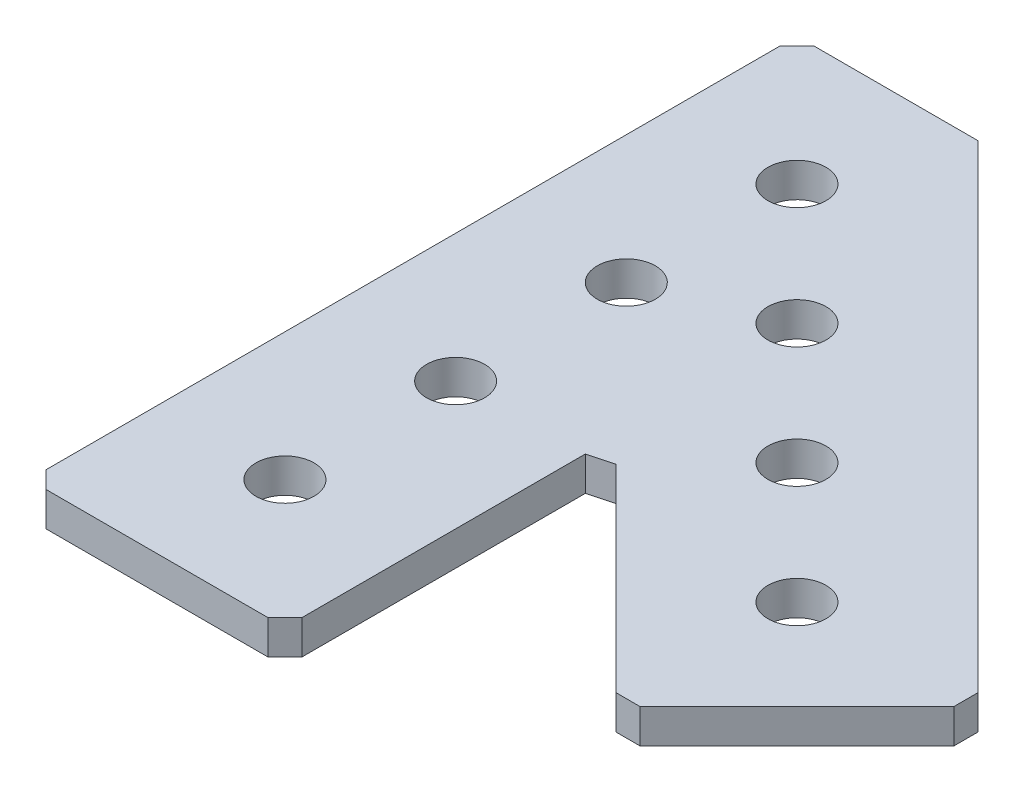
ISO-10303-21;
HEADER;
FILE_DESCRIPTION(('STEP AP214'),'2;1');
FILE_NAME('part.step','',(''),(''),'','','');
FILE_SCHEMA(('AUTOMOTIVE_DESIGN { 1 0 10303 214 1 1 1 1 }'));
ENDSEC;
DATA;
#1=APPLICATION_CONTEXT('core data for automotive mechanical design processes');
#2=APPLICATION_PROTOCOL_DEFINITION('international standard','automotive_design',2000,#1);
#3=PRODUCT_CONTEXT('',#1,'mechanical');
#4=PRODUCT('Part','Part','',(#3));
#5=PRODUCT_RELATED_PRODUCT_CATEGORY('part','',(#4));
#6=PRODUCT_DEFINITION_FORMATION('','',#4);
#7=PRODUCT_DEFINITION_CONTEXT('part definition',#1,'design');
#8=PRODUCT_DEFINITION('design','',#6,#7);
#9=PRODUCT_DEFINITION_SHAPE('','',#8);
#10=(LENGTH_UNIT() NAMED_UNIT(*) SI_UNIT(.MILLI.,.METRE.));
#11=(NAMED_UNIT(*) PLANE_ANGLE_UNIT() SI_UNIT($,.RADIAN.));
#12=(NAMED_UNIT(*) SI_UNIT($,.STERADIAN.) SOLID_ANGLE_UNIT());
#13=UNCERTAINTY_MEASURE_WITH_UNIT(LENGTH_MEASURE(1.E-05),#10,'distance_accuracy_value','');
#14=(GEOMETRIC_REPRESENTATION_CONTEXT(3) GLOBAL_UNCERTAINTY_ASSIGNED_CONTEXT((#13)) GLOBAL_UNIT_ASSIGNED_CONTEXT((#10,
#11,#12)) REPRESENTATION_CONTEXT('',''));
#15=CARTESIAN_POINT('',(0.,0.,0.));
#16=DIRECTION('',(0.,0.,1.));
#17=DIRECTION('',(1.,0.,0.));
#18=AXIS2_PLACEMENT_3D('',#15,#16,#17);
#19=CARTESIAN_POINT('',(7.50000000000001,2.,36.5));
#20=DIRECTION('',(-0.707106781186542,0.,-0.707106781186553));
#21=DIRECTION('',(-0.707106781186553,0.,0.707106781186542));
#22=AXIS2_PLACEMENT_3D('',#19,#20,#21);
#23=PLANE('',#22);
#24=DIRECTION('',(0.,1.,0.));
#25=VECTOR('',#24,1.);
#26=CARTESIAN_POINT('',(6.49999999999998,2.,37.5));
#27=LINE('',#26,#25);
#28=CARTESIAN_POINT('',(6.49999999999999,2.,37.5));
#29=VERTEX_POINT('',#28);
#30=CARTESIAN_POINT('',(6.49999999999998,0.,37.5));
#31=VERTEX_POINT('',#30);
#32=EDGE_CURVE('E133',#29,#31,#27,.F.);
#33=ORIENTED_EDGE('',*,*,#32,.T.);
#34=DIRECTION('',(-0.707106781186553,0.,0.707106781186542));
#35=VECTOR('',#34,1.);
#36=CARTESIAN_POINT('',(7.50000000000001,0.,36.5));
#37=LINE('',#36,#35);
#38=CARTESIAN_POINT('',(7.50000000000001,0.,36.5));
#39=VERTEX_POINT('',#38);
#40=EDGE_CURVE('E160',#39,#31,#37,.T.);
#41=ORIENTED_EDGE('',*,*,#40,.F.);
#42=DIRECTION('',(0.,1.,0.));
#43=VECTOR('',#42,1.);
#44=CARTESIAN_POINT('',(7.50000000000001,2.,36.5));
#45=LINE('',#44,#43);
#46=CARTESIAN_POINT('',(7.50000000000001,2.,36.5));
#47=VERTEX_POINT('',#46);
#48=EDGE_CURVE('E434',#39,#47,#45,.T.);
#49=ORIENTED_EDGE('',*,*,#48,.T.);
#50=DIRECTION('',(0.707106781186551,0.,-0.707106781186544));
#51=VECTOR('',#50,1.);
#52=CARTESIAN_POINT('',(6.49999999999998,2.,37.5));
#53=LINE('',#52,#51);
#54=EDGE_CURVE('E109',#29,#47,#53,.T.);
#55=ORIENTED_EDGE('',*,*,#54,.F.);
#56=EDGE_LOOP('',(#33,#41,#49,#55));
#57=FACE_BOUND('',#56,.T.);
#58=ADVANCED_FACE('F17',(#57),#23,.F.);
#59=CARTESIAN_POINT('',(8.9142135623731,2.,19.5208152801713));
#60=DIRECTION('',(0.258819045102524,0.,0.965925826289067));
#61=DIRECTION('',(0.965925826289067,0.,-0.258819045102524));
#62=AXIS2_PLACEMENT_3D('',#59,#60,#61);
#63=PLANE('',#62);
#64=DIRECTION('',(0.965925826289067,0.,-0.258819045102524));
#65=VECTOR('',#64,1.);
#66=CARTESIAN_POINT('',(8.9142135623731,0.,19.5208152801713));
#67=LINE('',#66,#65);
#68=CARTESIAN_POINT('',(7.50000000000001,0.,19.8997526621343));
#69=VERTEX_POINT('',#68);
#70=CARTESIAN_POINT('',(8.91421356237309,0.,19.5208152801713));
#71=VERTEX_POINT('',#70);
#72=EDGE_CURVE('E158',#69,#71,#67,.T.);
#73=ORIENTED_EDGE('',*,*,#72,.T.);
#74=DIRECTION('',(0.,1.,0.));
#75=VECTOR('',#74,1.);
#76=CARTESIAN_POINT('',(8.9142135623731,2.,19.5208152801713));
#77=LINE('',#76,#75);
#78=CARTESIAN_POINT('',(8.91421356237309,2.,19.5208152801713));
#79=VERTEX_POINT('',#78);
#80=EDGE_CURVE('E472',#71,#79,#77,.T.);
#81=ORIENTED_EDGE('',*,*,#80,.T.);
#82=DIRECTION('',(0.965925826289066,0.,-0.25881904510253));
#83=VECTOR('',#82,1.);
#84=CARTESIAN_POINT('',(7.50000000000001,2.,19.8997526621343));
#85=LINE('',#84,#83);
#86=CARTESIAN_POINT('',(7.50000000000001,2.,19.8997526621343));
#87=VERTEX_POINT('',#86);
#88=EDGE_CURVE('E148',#87,#79,#85,.T.);
#89=ORIENTED_EDGE('',*,*,#88,.F.);
#90=DIRECTION('',(0.,1.,0.));
#91=VECTOR('',#90,1.);
#92=CARTESIAN_POINT('',(7.5,2.,19.8997526621343));
#93=LINE('',#92,#91);
#94=EDGE_CURVE('E478',#87,#69,#93,.F.);
#95=ORIENTED_EDGE('',*,*,#94,.T.);
#96=EDGE_LOOP('',(#73,#81,#89,#95));
#97=FACE_BOUND('',#96,.T.);
#98=ADVANCED_FACE('F407',(#97),#63,.T.);
#99=CARTESIAN_POINT('',(21.920310216783,2.,31.1126983722081));
#100=DIRECTION('',(0.,0.,-1.));
#101=DIRECTION('',(-1.,0.,0.));
#102=AXIS2_PLACEMENT_3D('',#99,#100,#101);
#103=PLANE('',#102);
#104=DIRECTION('',(0.,1.,0.));
#105=VECTOR('',#104,1.);
#106=CARTESIAN_POINT('',(20.5060966544099,2.,31.1126983722081));
#107=LINE('',#106,#105);
#108=CARTESIAN_POINT('',(20.5060966544099,2.,31.1126983722081));
#109=VERTEX_POINT('',#108);
#110=CARTESIAN_POINT('',(20.5060966544099,0.,31.1126983722081));
#111=VERTEX_POINT('',#110);
#112=EDGE_CURVE('E475',#109,#111,#107,.F.);
#113=ORIENTED_EDGE('',*,*,#112,.T.);
#114=DIRECTION('',(-1.,0.,0.));
#115=VECTOR('',#114,1.);
#116=CARTESIAN_POINT('',(21.920310216783,0.,31.1126983722081));
#117=LINE('',#116,#115);
#118=CARTESIAN_POINT('',(21.920310216783,0.,31.1126983722081));
#119=VERTEX_POINT('',#118);
#120=EDGE_CURVE('E156',#119,#111,#117,.T.);
#121=ORIENTED_EDGE('',*,*,#120,.F.);
#122=DIRECTION('',(0.,1.,0.));
#123=VECTOR('',#122,1.);
#124=CARTESIAN_POINT('',(21.920310216783,2.,31.1126983722081));
#125=LINE('',#124,#123);
#126=CARTESIAN_POINT('',(21.920310216783,2.,31.1126983722081));
#127=VERTEX_POINT('',#126);
#128=EDGE_CURVE('E463',#119,#127,#125,.T.);
#129=ORIENTED_EDGE('',*,*,#128,.T.);
#130=DIRECTION('',(1.,0.,0.));
#131=VECTOR('',#130,1.);
#132=CARTESIAN_POINT('',(0.,2.,31.1126983722081));
#133=LINE('',#132,#131);
#134=EDGE_CURVE('E146',#109,#127,#133,.T.);
#135=ORIENTED_EDGE('',*,*,#134,.F.);
#136=EDGE_LOOP('',(#113,#121,#129,#135));
#137=FACE_BOUND('',#136,.T.);
#138=ADVANCED_FACE('F398',(#137),#103,.F.);
#139=CARTESIAN_POINT('',(31.1126983722081,2.,20.5060966544098));
#140=DIRECTION('',(-1.,0.,0.));
#141=DIRECTION('',(0.,0.,1.));
#142=AXIS2_PLACEMENT_3D('',#139,#140,#141);
#143=PLANE('',#142);
#144=DIRECTION('',(0.,1.,0.));
#145=VECTOR('',#144,1.);
#146=CARTESIAN_POINT('',(31.1126983722081,2.,21.9203102167829));
#147=LINE('',#146,#145);
#148=CARTESIAN_POINT('',(31.1126983722081,2.,21.9203102167829));
#149=VERTEX_POINT('',#148);
#150=CARTESIAN_POINT('',(31.1126983722081,0.,21.9203102167829));
#151=VERTEX_POINT('',#150);
#152=EDGE_CURVE('E466',#149,#151,#147,.F.);
#153=ORIENTED_EDGE('',*,*,#152,.T.);
#154=DIRECTION('',(0.,0.,1.));
#155=VECTOR('',#154,1.);
#156=CARTESIAN_POINT('',(31.1126983722081,0.,20.5060966544098));
#157=LINE('',#156,#155);
#158=CARTESIAN_POINT('',(31.1126983722081,0.,20.5060966544098));
#159=VERTEX_POINT('',#158);
#160=EDGE_CURVE('E154',#159,#151,#157,.T.);
#161=ORIENTED_EDGE('',*,*,#160,.F.);
#162=DIRECTION('',(0.,1.,0.));
#163=VECTOR('',#162,1.);
#164=CARTESIAN_POINT('',(31.1126983722081,2.,20.5060966544098));
#165=LINE('',#164,#163);
#166=CARTESIAN_POINT('',(31.1126983722081,2.,20.5060966544098));
#167=VERTEX_POINT('',#166);
#168=EDGE_CURVE('E457',#159,#167,#165,.T.);
#169=ORIENTED_EDGE('',*,*,#168,.T.);
#170=DIRECTION('',(0.,0.,1.));
#171=VECTOR('',#170,1.);
#172=CARTESIAN_POINT('',(31.1126983722081,2.,0.));
#173=LINE('',#172,#171);
#174=EDGE_CURVE('E144',#149,#167,#173,.F.);
#175=ORIENTED_EDGE('',*,*,#174,.F.);
#176=EDGE_LOOP('',(#153,#161,#169,#175));
#177=FACE_BOUND('',#176,.T.);
#178=ADVANCED_FACE('F390',(#177),#143,.F.);
#179=CARTESIAN_POINT('',(-7.5,2.,-6.5));
#180=DIRECTION('',(0.707106781186545,0.,0.70710678118655));
#181=DIRECTION('',(0.70710678118655,0.,-0.707106781186545));
#182=AXIS2_PLACEMENT_3D('',#179,#180,#181);
#183=PLANE('',#182);
#184=DIRECTION('',(0.,1.,0.));
#185=VECTOR('',#184,1.);
#186=CARTESIAN_POINT('',(-6.49999999999999,2.,-7.5));
#187=LINE('',#186,#185);
#188=CARTESIAN_POINT('',(-6.5,2.,-7.5));
#189=VERTEX_POINT('',#188);
#190=CARTESIAN_POINT('',(-6.5,0.,-7.5));
#191=VERTEX_POINT('',#190);
#192=EDGE_CURVE('E447',#189,#191,#187,.F.);
#193=ORIENTED_EDGE('',*,*,#192,.T.);
#194=DIRECTION('',(0.70710678118655,0.,-0.707106781186545));
#195=VECTOR('',#194,1.);
#196=CARTESIAN_POINT('',(-7.5,0.,-6.5));
#197=LINE('',#196,#195);
#198=CARTESIAN_POINT('',(-7.5,0.,-6.5));
#199=VERTEX_POINT('',#198);
#200=EDGE_CURVE('E35',#199,#191,#197,.T.);
#201=ORIENTED_EDGE('',*,*,#200,.F.);
#202=DIRECTION('',(0.,1.,0.));
#203=VECTOR('',#202,1.);
#204=CARTESIAN_POINT('',(-7.5,2.,-6.5));
#205=LINE('',#204,#203);
#206=CARTESIAN_POINT('',(-7.5,2.,-6.5));
#207=VERTEX_POINT('',#206);
#208=EDGE_CURVE('E445',#199,#207,#205,.T.);
#209=ORIENTED_EDGE('',*,*,#208,.T.);
#210=DIRECTION('',(-0.70710678118655,0.,0.707106781186545));
#211=VECTOR('',#210,1.);
#212=CARTESIAN_POINT('',(-6.49999999999999,2.,-7.5));
#213=LINE('',#212,#211);
#214=EDGE_CURVE('E125',#189,#207,#213,.T.);
#215=ORIENTED_EDGE('',*,*,#214,.F.);
#216=EDGE_LOOP('',(#193,#201,#209,#215));
#217=FACE_BOUND('',#216,.T.);
#218=ADVANCED_FACE('F382',(#217),#183,.F.);
#219=CARTESIAN_POINT('',(-6.49999999999999,2.,37.5));
#220=DIRECTION('',(0.707106781186553,0.,-0.707106781186543));
#221=DIRECTION('',(-0.707106781186543,0.,-0.707106781186553));
#222=AXIS2_PLACEMENT_3D('',#219,#220,#221);
#223=PLANE('',#222);
#224=DIRECTION('',(0.,1.,0.));
#225=VECTOR('',#224,1.);
#226=CARTESIAN_POINT('',(-7.5,2.,36.5));
#227=LINE('',#226,#225);
#228=CARTESIAN_POINT('',(-7.50000000000001,2.,36.5));
#229=VERTEX_POINT('',#228);
#230=CARTESIAN_POINT('',(-7.50000000000001,0.,36.5));
#231=VERTEX_POINT('',#230);
#232=EDGE_CURVE('E192',#229,#231,#227,.F.);
#233=ORIENTED_EDGE('',*,*,#232,.T.);
#234=DIRECTION('',(-0.707106781186543,0.,-0.707106781186553));
#235=VECTOR('',#234,1.);
#236=CARTESIAN_POINT('',(-6.49999999999999,0.,37.5));
#237=LINE('',#236,#235);
#238=CARTESIAN_POINT('',(-6.49999999999999,0.,37.5));
#239=VERTEX_POINT('',#238);
#240=EDGE_CURVE('E136',#239,#231,#237,.T.);
#241=ORIENTED_EDGE('',*,*,#240,.F.);
#242=DIRECTION('',(0.,1.,0.));
#243=VECTOR('',#242,1.);
#244=CARTESIAN_POINT('',(-6.49999999999999,2.,37.5));
#245=LINE('',#244,#243);
#246=CARTESIAN_POINT('',(-6.49999999999999,2.,37.5));
#247=VERTEX_POINT('',#246);
#248=EDGE_CURVE('E131',#239,#247,#245,.T.);
#249=ORIENTED_EDGE('',*,*,#248,.T.);
#250=DIRECTION('',(0.707106781186543,0.,0.707106781186552));
#251=VECTOR('',#250,1.);
#252=CARTESIAN_POINT('',(-7.5,2.,36.5));
#253=LINE('',#252,#251);
#254=EDGE_CURVE('E115',#229,#247,#253,.T.);
#255=ORIENTED_EDGE('',*,*,#254,.F.);
#256=EDGE_LOOP('',(#233,#241,#249,#255));
#257=FACE_BOUND('',#256,.T.);
#258=ADVANCED_FACE('F135',(#257),#223,.F.);
#259=CARTESIAN_POINT('',(0.,2.,0.));
#260=DIRECTION('',(0.,1.,0.));
#261=DIRECTION('',(0.,0.,1.));
#262=AXIS2_PLACEMENT_3D('',#259,#260,#261);
#263=PLANE('',#262);
#264=CARTESIAN_POINT('',(0.,2.,20.));
#265=DIRECTION('',(0.,-1.,0.));
#266=DIRECTION('',(0.,0.,-1.));
#267=AXIS2_PLACEMENT_3D('',#264,#265,#266);
#268=CIRCLE('',#267,1.7);
#269=CARTESIAN_POINT('',(0.,2.,18.3));
#270=VERTEX_POINT('',#269);
#271=EDGE_CURVE('E181',#270,#270,#268,.T.);
#272=ORIENTED_EDGE('',*,*,#271,.T.);
#273=EDGE_LOOP('',(#272));
#274=FACE_BOUND('',#273,.T.);
#275=CARTESIAN_POINT('',(0.,2.,30.));
#276=DIRECTION('',(0.,-1.,0.));
#277=DIRECTION('',(0.,0.,-1.));
#278=AXIS2_PLACEMENT_3D('',#275,#276,#277);
#279=CIRCLE('',#278,1.7);
#280=CARTESIAN_POINT('',(0.,2.,28.3));
#281=VERTEX_POINT('',#280);
#282=EDGE_CURVE('E184',#281,#281,#279,.T.);
#283=ORIENTED_EDGE('',*,*,#282,.T.);
#284=EDGE_LOOP('',(#283));
#285=FACE_BOUND('',#284,.T.);
#286=CARTESIAN_POINT('',(14.142135623731,2.,14.1421356237309));
#287=DIRECTION('',(0.,-1.,0.));
#288=DIRECTION('',(0.,0.,-1.));
#289=AXIS2_PLACEMENT_3D('',#286,#287,#288);
#290=CIRCLE('',#289,1.7);
#291=CARTESIAN_POINT('',(14.142135623731,2.,12.4421356237309));
#292=VERTEX_POINT('',#291);
#293=EDGE_CURVE('E187',#292,#292,#290,.T.);
#294=ORIENTED_EDGE('',*,*,#293,.T.);
#295=EDGE_LOOP('',(#294));
#296=FACE_BOUND('',#295,.T.);
#297=CARTESIAN_POINT('',(21.2132034355965,2.,21.2132034355964));
#298=DIRECTION('',(0.,-1.,0.));
#299=DIRECTION('',(0.,0.,-1.));
#300=AXIS2_PLACEMENT_3D('',#297,#298,#299);
#301=CIRCLE('',#300,1.7);
#302=CARTESIAN_POINT('',(21.2132034355965,2.,19.5132034355964));
#303=VERTEX_POINT('',#302);
#304=EDGE_CURVE('E190',#303,#303,#301,.T.);
#305=ORIENTED_EDGE('',*,*,#304,.T.);
#306=EDGE_LOOP('',(#305));
#307=FACE_BOUND('',#306,.T.);
#308=CARTESIAN_POINT('',(0.,2.,0.));
#309=DIRECTION('',(0.,-1.,0.));
#310=DIRECTION('',(0.,0.,-1.));
#311=AXIS2_PLACEMENT_3D('',#308,#309,#310);
#312=CIRCLE('',#311,1.7);
#313=CARTESIAN_POINT('',(0.,2.,-1.69999999999999));
#314=VERTEX_POINT('',#313);
#315=EDGE_CURVE('E137',#314,#314,#312,.T.);
#316=ORIENTED_EDGE('',*,*,#315,.T.);
#317=EDGE_LOOP('',(#316));
#318=FACE_BOUND('',#317,.T.);
#319=CARTESIAN_POINT('',(7.0710678118655,2.,7.07106781186547));
#320=DIRECTION('',(0.,-1.,0.));
#321=DIRECTION('',(0.,0.,-1.));
#322=AXIS2_PLACEMENT_3D('',#319,#320,#321);
#323=CIRCLE('',#322,1.7);
#324=CARTESIAN_POINT('',(7.0710678118655,2.,5.37106781186547));
#325=VERTEX_POINT('',#324);
#326=EDGE_CURVE('E140',#325,#325,#323,.T.);
#327=ORIENTED_EDGE('',*,*,#326,.T.);
#328=EDGE_LOOP('',(#327));
#329=FACE_BOUND('',#328,.T.);
#330=CARTESIAN_POINT('',(0.,2.,10.));
#331=DIRECTION('',(0.,-1.,0.));
#332=DIRECTION('',(0.,0.,-1.));
#333=AXIS2_PLACEMENT_3D('',#330,#331,#332);
#334=CIRCLE('',#333,1.7);
#335=CARTESIAN_POINT('',(0.,2.,8.30000000000001));
#336=VERTEX_POINT('',#335);
#337=EDGE_CURVE('E20',#336,#336,#334,.T.);
#338=ORIENTED_EDGE('',*,*,#337,.T.);
#339=EDGE_LOOP('',(#338));
#340=FACE_BOUND('',#339,.T.);
#341=DIRECTION('',(0.707106781186549,0.,0.707106781186546));
#342=VECTOR('',#341,1.);
#343=CARTESIAN_POINT('',(0.,2.,-10.6066017177982));
#344=LINE('',#343,#342);
#345=CARTESIAN_POINT('',(3.10660171779821,2.,-7.5));
#346=VERTEX_POINT('',#345);
#347=EDGE_CURVE('E455',#167,#346,#344,.F.);
#348=ORIENTED_EDGE('',*,*,#347,.T.);
#349=DIRECTION('',(1.,0.,0.));
#350=VECTOR('',#349,1.);
#351=CARTESIAN_POINT('',(-7.5,2.,-7.5));
#352=LINE('',#351,#350);
#353=EDGE_CURVE('E449',#346,#189,#352,.F.);
#354=ORIENTED_EDGE('',*,*,#353,.T.);
#355=ORIENTED_EDGE('',*,*,#214,.T.);
#356=DIRECTION('',(0.,0.,-1.));
#357=VECTOR('',#356,1.);
#358=CARTESIAN_POINT('',(-7.5,2.,-7.5));
#359=LINE('',#358,#357);
#360=EDGE_CURVE('E120',#207,#229,#359,.F.);
#361=ORIENTED_EDGE('',*,*,#360,.T.);
#362=ORIENTED_EDGE('',*,*,#254,.T.);
#363=DIRECTION('',(-1.,0.,0.));
#364=VECTOR('',#363,1.);
#365=CARTESIAN_POINT('',(-7.5,2.,37.5));
#366=LINE('',#365,#364);
#367=EDGE_CURVE('E118',#247,#29,#366,.F.);
#368=ORIENTED_EDGE('',*,*,#367,.T.);
#369=ORIENTED_EDGE('',*,*,#54,.T.);
#370=DIRECTION('',(0.,0.,1.));
#371=VECTOR('',#370,1.);
#372=CARTESIAN_POINT('',(7.5,2.,-7.5));
#373=LINE('',#372,#371);
#374=EDGE_CURVE('E481',#47,#87,#373,.F.);
#375=ORIENTED_EDGE('',*,*,#374,.T.);
#376=ORIENTED_EDGE('',*,*,#88,.T.);
#377=DIRECTION('',(-0.707106781186549,0.,-0.707106781186546));
#378=VECTOR('',#377,1.);
#379=CARTESIAN_POINT('',(-10.6066017177982,2.,0.));
#380=LINE('',#379,#378);
#381=EDGE_CURVE('E469',#79,#109,#380,.F.);
#382=ORIENTED_EDGE('',*,*,#381,.T.);
#383=ORIENTED_EDGE('',*,*,#134,.T.);
#384=DIRECTION('',(-0.707106781186546,0.,0.707106781186549));
#385=VECTOR('',#384,1.);
#386=CARTESIAN_POINT('',(21.2132034355965,2.,31.8198051533946));
#387=LINE('',#386,#385);
#388=EDGE_CURVE('E460',#127,#149,#387,.F.);
#389=ORIENTED_EDGE('',*,*,#388,.T.);
#390=ORIENTED_EDGE('',*,*,#174,.T.);
#391=EDGE_LOOP('',(#348,#354,#355,#361,#362,#368,#369,#375,#376,#382,#383,#389,#390));
#392=FACE_BOUND('',#391,.T.);
#393=ADVANCED_FACE('F117',(#274,#285,#296,#307,#318,#329,#340,#392),#263,.T.);
#394=CARTESIAN_POINT('',(0.,2.,10.));
#395=DIRECTION('',(0.,-1.,0.));
#396=DIRECTION('',(0.,0.,-1.));
#397=AXIS2_PLACEMENT_3D('',#394,#395,#396);
#398=CYLINDRICAL_SURFACE('',#397,1.7);
#399=CARTESIAN_POINT('',(0.,0.,10.));
#400=DIRECTION('',(0.,-1.,0.));
#401=DIRECTION('',(0.,0.,-1.));
#402=AXIS2_PLACEMENT_3D('',#399,#400,#401);
#403=CIRCLE('',#402,1.7);
#404=CARTESIAN_POINT('',(0.,0.,8.30000000000001));
#405=VERTEX_POINT('',#404);
#406=EDGE_CURVE('E178',#405,#405,#403,.T.);
#407=ORIENTED_EDGE('',*,*,#406,.T.);
#408=EDGE_LOOP('',(#407));
#409=FACE_BOUND('',#408,.T.);
#410=ORIENTED_EDGE('',*,*,#337,.F.);
#411=EDGE_LOOP('',(#410));
#412=FACE_BOUND('',#411,.T.);
#413=ADVANCED_FACE('F200',(#409,#412),#398,.F.);
#414=CARTESIAN_POINT('',(7.0710678118655,2.,7.07106781186547));
#415=DIRECTION('',(0.,-1.,0.));
#416=DIRECTION('',(0.,0.,-1.));
#417=AXIS2_PLACEMENT_3D('',#414,#415,#416);
#418=CYLINDRICAL_SURFACE('',#417,1.7);
#419=CARTESIAN_POINT('',(7.0710678118655,0.,7.07106781186547));
#420=DIRECTION('',(0.,-1.,0.));
#421=DIRECTION('',(0.,0.,-1.));
#422=AXIS2_PLACEMENT_3D('',#419,#420,#421);
#423=CIRCLE('',#422,1.7);
#424=CARTESIAN_POINT('',(7.0710678118655,0.,5.37106781186547));
#425=VERTEX_POINT('',#424);
#426=EDGE_CURVE('E175',#425,#425,#423,.T.);
#427=ORIENTED_EDGE('',*,*,#426,.T.);
#428=EDGE_LOOP('',(#427));
#429=FACE_BOUND('',#428,.T.);
#430=ORIENTED_EDGE('',*,*,#326,.F.);
#431=EDGE_LOOP('',(#430));
#432=FACE_BOUND('',#431,.T.);
#433=ADVANCED_FACE('F202',(#429,#432),#418,.F.);
#434=CARTESIAN_POINT('',(0.,2.,0.));
#435=DIRECTION('',(0.,-1.,0.));
#436=DIRECTION('',(0.,0.,-1.));
#437=AXIS2_PLACEMENT_3D('',#434,#435,#436);
#438=CYLINDRICAL_SURFACE('',#437,1.7);
#439=CARTESIAN_POINT('',(0.,0.,0.));
#440=DIRECTION('',(0.,-1.,0.));
#441=DIRECTION('',(0.,0.,-1.));
#442=AXIS2_PLACEMENT_3D('',#439,#440,#441);
#443=CIRCLE('',#442,1.7);
#444=CARTESIAN_POINT('',(0.,0.,-1.69999999999999));
#445=VERTEX_POINT('',#444);
#446=EDGE_CURVE('E171',#445,#445,#443,.T.);
#447=ORIENTED_EDGE('',*,*,#446,.T.);
#448=EDGE_LOOP('',(#447));
#449=FACE_BOUND('',#448,.T.);
#450=ORIENTED_EDGE('',*,*,#315,.F.);
#451=EDGE_LOOP('',(#450));
#452=FACE_BOUND('',#451,.T.);
#453=ADVANCED_FACE('F210',(#449,#452),#438,.F.);
#454=CARTESIAN_POINT('',(-7.5,2.,37.5));
#455=DIRECTION('',(0.,0.,-1.));
#456=DIRECTION('',(-1.,0.,0.));
#457=AXIS2_PLACEMENT_3D('',#454,#455,#456);
#458=PLANE('',#457);
#459=ORIENTED_EDGE('',*,*,#32,.F.);
#460=ORIENTED_EDGE('',*,*,#367,.F.);
#461=ORIENTED_EDGE('',*,*,#248,.F.);
#462=DIRECTION('',(1.,0.,0.));
#463=VECTOR('',#462,1.);
#464=CARTESIAN_POINT('',(0.,0.,37.5));
#465=LINE('',#464,#463);
#466=EDGE_CURVE('E174',#239,#31,#465,.T.);
#467=ORIENTED_EDGE('',*,*,#466,.T.);
#468=EDGE_LOOP('',(#459,#460,#461,#467));
#469=FACE_BOUND('',#468,.T.);
#470=ADVANCED_FACE('F129',(#469),#458,.F.);
#471=CARTESIAN_POINT('',(7.5,2.,-7.5));
#472=DIRECTION('',(-1.,0.,0.));
#473=DIRECTION('',(0.,0.,1.));
#474=AXIS2_PLACEMENT_3D('',#471,#472,#473);
#475=PLANE('',#474);
#476=ORIENTED_EDGE('',*,*,#94,.F.);
#477=ORIENTED_EDGE('',*,*,#374,.F.);
#478=ORIENTED_EDGE('',*,*,#48,.F.);
#479=DIRECTION('',(0.,0.,1.));
#480=VECTOR('',#479,1.);
#481=CARTESIAN_POINT('',(7.50000000000001,0.,0.));
#482=LINE('',#481,#480);
#483=EDGE_CURVE('E436',#39,#69,#482,.F.);
#484=ORIENTED_EDGE('',*,*,#483,.T.);
#485=EDGE_LOOP('',(#476,#477,#478,#484));
#486=FACE_BOUND('',#485,.T.);
#487=ADVANCED_FACE('F259',(#486),#475,.F.);
#488=CARTESIAN_POINT('',(-10.6066017177982,2.,0.));
#489=DIRECTION('',(0.707106781186546,0.,-0.707106781186549));
#490=DIRECTION('',(-0.707106781186549,0.,-0.707106781186546));
#491=AXIS2_PLACEMENT_3D('',#488,#489,#490);
#492=PLANE('',#491);
#493=ORIENTED_EDGE('',*,*,#80,.F.);
#494=DIRECTION('',(0.707106781186549,0.,0.707106781186546));
#495=VECTOR('',#494,1.);
#496=CARTESIAN_POINT('',(8.91421356237309,0.,19.5208152801713));
#497=LINE('',#496,#495);
#498=EDGE_CURVE('E439',#71,#111,#497,.T.);
#499=ORIENTED_EDGE('',*,*,#498,.T.);
#500=ORIENTED_EDGE('',*,*,#112,.F.);
#501=ORIENTED_EDGE('',*,*,#381,.F.);
#502=EDGE_LOOP('',(#493,#499,#500,#501));
#503=FACE_BOUND('',#502,.T.);
#504=ADVANCED_FACE('F255',(#503),#492,.F.);
#505=CARTESIAN_POINT('',(21.2132034355965,2.,31.8198051533946));
#506=DIRECTION('',(-0.707106781186549,0.,-0.707106781186546));
#507=DIRECTION('',(-0.707106781186546,0.,0.707106781186549));
#508=AXIS2_PLACEMENT_3D('',#505,#506,#507);
#509=PLANE('',#508);
#510=ORIENTED_EDGE('',*,*,#128,.F.);
#511=DIRECTION('',(0.707106781186546,0.,-0.707106781186549));
#512=VECTOR('',#511,1.);
#513=CARTESIAN_POINT('',(21.920310216783,0.,31.1126983722081));
#514=LINE('',#513,#512);
#515=EDGE_CURVE('E497',#119,#151,#514,.T.);
#516=ORIENTED_EDGE('',*,*,#515,.T.);
#517=ORIENTED_EDGE('',*,*,#152,.F.);
#518=ORIENTED_EDGE('',*,*,#388,.F.);
#519=EDGE_LOOP('',(#510,#516,#517,#518));
#520=FACE_BOUND('',#519,.T.);
#521=ADVANCED_FACE('F251',(#520),#509,.F.);
#522=CARTESIAN_POINT('',(0.,2.,-10.6066017177982));
#523=DIRECTION('',(-0.707106781186546,0.,0.707106781186549));
#524=DIRECTION('',(0.707106781186549,0.,0.707106781186546));
#525=AXIS2_PLACEMENT_3D('',#522,#523,#524);
#526=PLANE('',#525);
#527=ORIENTED_EDGE('',*,*,#168,.F.);
#528=DIRECTION('',(-0.707106781186549,0.,-0.707106781186546));
#529=VECTOR('',#528,1.);
#530=CARTESIAN_POINT('',(31.1126983722081,0.,20.5060966544098));
#531=LINE('',#530,#529);
#532=CARTESIAN_POINT('',(3.10660171779821,0.,-7.5));
#533=VERTEX_POINT('',#532);
#534=EDGE_CURVE('E503',#159,#533,#531,.T.);
#535=ORIENTED_EDGE('',*,*,#534,.T.);
#536=DIRECTION('',(0.,1.,0.));
#537=VECTOR('',#536,1.);
#538=CARTESIAN_POINT('',(3.10660171779821,2.,-7.5));
#539=LINE('',#538,#537);
#540=EDGE_CURVE('E452',#533,#346,#539,.T.);
#541=ORIENTED_EDGE('',*,*,#540,.T.);
#542=ORIENTED_EDGE('',*,*,#347,.F.);
#543=EDGE_LOOP('',(#527,#535,#541,#542));
#544=FACE_BOUND('',#543,.T.);
#545=ADVANCED_FACE('F247',(#544),#526,.F.);
#546=CARTESIAN_POINT('',(-7.5,2.,-7.5));
#547=DIRECTION('',(0.,0.,1.));
#548=DIRECTION('',(1.,0.,0.));
#549=AXIS2_PLACEMENT_3D('',#546,#547,#548);
#550=PLANE('',#549);
#551=ORIENTED_EDGE('',*,*,#192,.F.);
#552=ORIENTED_EDGE('',*,*,#353,.F.);
#553=ORIENTED_EDGE('',*,*,#540,.F.);
#554=DIRECTION('',(1.,0.,0.));
#555=VECTOR('',#554,1.);
#556=CARTESIAN_POINT('',(0.,0.,-7.5));
#557=LINE('',#556,#555);
#558=EDGE_CURVE('E507',#533,#191,#557,.F.);
#559=ORIENTED_EDGE('',*,*,#558,.T.);
#560=EDGE_LOOP('',(#551,#552,#553,#559));
#561=FACE_BOUND('',#560,.T.);
#562=ADVANCED_FACE('F243',(#561),#550,.F.);
#563=CARTESIAN_POINT('',(-7.5,2.,-7.5));
#564=DIRECTION('',(1.,0.,0.));
#565=DIRECTION('',(0.,0.,-1.));
#566=AXIS2_PLACEMENT_3D('',#563,#564,#565);
#567=PLANE('',#566);
#568=ORIENTED_EDGE('',*,*,#232,.F.);
#569=ORIENTED_EDGE('',*,*,#360,.F.);
#570=ORIENTED_EDGE('',*,*,#208,.F.);
#571=DIRECTION('',(0.,0.,1.));
#572=VECTOR('',#571,1.);
#573=CARTESIAN_POINT('',(-7.5,0.,0.));
#574=LINE('',#573,#572);
#575=EDGE_CURVE('E170',#199,#231,#574,.T.);
#576=ORIENTED_EDGE('',*,*,#575,.T.);
#577=EDGE_LOOP('',(#568,#569,#570,#576));
#578=FACE_BOUND('',#577,.T.);
#579=ADVANCED_FACE('F239',(#578),#567,.F.);
#580=CARTESIAN_POINT('',(21.2132034355965,2.,21.2132034355964));
#581=DIRECTION('',(0.,-1.,0.));
#582=DIRECTION('',(0.,0.,-1.));
#583=AXIS2_PLACEMENT_3D('',#580,#581,#582);
#584=CYLINDRICAL_SURFACE('',#583,1.7);
#585=CARTESIAN_POINT('',(21.2132034355965,0.,21.2132034355964));
#586=DIRECTION('',(0.,-1.,0.));
#587=DIRECTION('',(0.,0.,-1.));
#588=AXIS2_PLACEMENT_3D('',#585,#586,#587);
#589=CIRCLE('',#588,1.7);
#590=CARTESIAN_POINT('',(21.2132034355965,0.,19.5132034355964));
#591=VERTEX_POINT('',#590);
#592=EDGE_CURVE('E167',#591,#591,#589,.T.);
#593=ORIENTED_EDGE('',*,*,#592,.T.);
#594=EDGE_LOOP('',(#593));
#595=FACE_BOUND('',#594,.T.);
#596=ORIENTED_EDGE('',*,*,#304,.F.);
#597=EDGE_LOOP('',(#596));
#598=FACE_BOUND('',#597,.T.);
#599=ADVANCED_FACE('F235',(#595,#598),#584,.F.);
#600=CARTESIAN_POINT('',(14.142135623731,2.,14.1421356237309));
#601=DIRECTION('',(0.,-1.,0.));
#602=DIRECTION('',(0.,0.,-1.));
#603=AXIS2_PLACEMENT_3D('',#600,#601,#602);
#604=CYLINDRICAL_SURFACE('',#603,1.7);
#605=CARTESIAN_POINT('',(14.142135623731,0.,14.1421356237309));
#606=DIRECTION('',(0.,-1.,0.));
#607=DIRECTION('',(0.,0.,-1.));
#608=AXIS2_PLACEMENT_3D('',#605,#606,#607);
#609=CIRCLE('',#608,1.7);
#610=CARTESIAN_POINT('',(14.142135623731,0.,12.4421356237309));
#611=VERTEX_POINT('',#610);
#612=EDGE_CURVE('E164',#611,#611,#609,.T.);
#613=ORIENTED_EDGE('',*,*,#612,.T.);
#614=EDGE_LOOP('',(#613));
#615=FACE_BOUND('',#614,.T.);
#616=ORIENTED_EDGE('',*,*,#293,.F.);
#617=EDGE_LOOP('',(#616));
#618=FACE_BOUND('',#617,.T.);
#619=ADVANCED_FACE('F231',(#615,#618),#604,.F.);
#620=CARTESIAN_POINT('',(0.,2.,30.));
#621=DIRECTION('',(0.,-1.,0.));
#622=DIRECTION('',(0.,0.,-1.));
#623=AXIS2_PLACEMENT_3D('',#620,#621,#622);
#624=CYLINDRICAL_SURFACE('',#623,1.7);
#625=CARTESIAN_POINT('',(0.,0.,30.));
#626=DIRECTION('',(0.,-1.,0.));
#627=DIRECTION('',(0.,0.,-1.));
#628=AXIS2_PLACEMENT_3D('',#625,#626,#627);
#629=CIRCLE('',#628,1.7);
#630=CARTESIAN_POINT('',(0.,0.,28.3));
#631=VERTEX_POINT('',#630);
#632=EDGE_CURVE('E26',#631,#631,#629,.T.);
#633=ORIENTED_EDGE('',*,*,#632,.T.);
#634=EDGE_LOOP('',(#633));
#635=FACE_BOUND('',#634,.T.);
#636=ORIENTED_EDGE('',*,*,#282,.F.);
#637=EDGE_LOOP('',(#636));
#638=FACE_BOUND('',#637,.T.);
#639=ADVANCED_FACE('F223',(#635,#638),#624,.F.);
#640=CARTESIAN_POINT('',(0.,2.,20.));
#641=DIRECTION('',(0.,-1.,0.));
#642=DIRECTION('',(0.,0.,-1.));
#643=AXIS2_PLACEMENT_3D('',#640,#641,#642);
#644=CYLINDRICAL_SURFACE('',#643,1.7);
#645=CARTESIAN_POINT('',(0.,0.,20.));
#646=DIRECTION('',(0.,-1.,0.));
#647=DIRECTION('',(0.,0.,-1.));
#648=AXIS2_PLACEMENT_3D('',#645,#646,#647);
#649=CIRCLE('',#648,1.7);
#650=CARTESIAN_POINT('',(0.,0.,18.3));
#651=VERTEX_POINT('',#650);
#652=EDGE_CURVE('E10',#651,#651,#649,.T.);
#653=ORIENTED_EDGE('',*,*,#652,.T.);
#654=EDGE_LOOP('',(#653));
#655=FACE_BOUND('',#654,.T.);
#656=ORIENTED_EDGE('',*,*,#271,.F.);
#657=EDGE_LOOP('',(#656));
#658=FACE_BOUND('',#657,.T.);
#659=ADVANCED_FACE('F217',(#655,#658),#644,.F.);
#660=CARTESIAN_POINT('',(0.,0.,0.));
#661=DIRECTION('',(0.,1.,0.));
#662=DIRECTION('',(0.,0.,1.));
#663=AXIS2_PLACEMENT_3D('',#660,#661,#662);
#664=PLANE('',#663);
#665=ORIENTED_EDGE('',*,*,#652,.F.);
#666=EDGE_LOOP('',(#665));
#667=FACE_BOUND('',#666,.T.);
#668=ORIENTED_EDGE('',*,*,#632,.F.);
#669=EDGE_LOOP('',(#668));
#670=FACE_BOUND('',#669,.T.);
#671=ORIENTED_EDGE('',*,*,#612,.F.);
#672=EDGE_LOOP('',(#671));
#673=FACE_BOUND('',#672,.T.);
#674=ORIENTED_EDGE('',*,*,#592,.F.);
#675=EDGE_LOOP('',(#674));
#676=FACE_BOUND('',#675,.T.);
#677=ORIENTED_EDGE('',*,*,#200,.T.);
#678=ORIENTED_EDGE('',*,*,#558,.F.);
#679=ORIENTED_EDGE('',*,*,#534,.F.);
#680=ORIENTED_EDGE('',*,*,#160,.T.);
#681=ORIENTED_EDGE('',*,*,#515,.F.);
#682=ORIENTED_EDGE('',*,*,#120,.T.);
#683=ORIENTED_EDGE('',*,*,#498,.F.);
#684=ORIENTED_EDGE('',*,*,#72,.F.);
#685=ORIENTED_EDGE('',*,*,#483,.F.);
#686=ORIENTED_EDGE('',*,*,#40,.T.);
#687=ORIENTED_EDGE('',*,*,#466,.F.);
#688=ORIENTED_EDGE('',*,*,#240,.T.);
#689=ORIENTED_EDGE('',*,*,#575,.F.);
#690=EDGE_LOOP('',(#677,#678,#679,#680,#681,#682,#683,#684,#685,#686,#687,#688,#689));
#691=FACE_BOUND('',#690,.T.);
#692=ORIENTED_EDGE('',*,*,#446,.F.);
#693=EDGE_LOOP('',(#692));
#694=FACE_BOUND('',#693,.T.);
#695=ORIENTED_EDGE('',*,*,#426,.F.);
#696=EDGE_LOOP('',(#695));
#697=FACE_BOUND('',#696,.T.);
#698=ORIENTED_EDGE('',*,*,#406,.F.);
#699=EDGE_LOOP('',(#698));
#700=FACE_BOUND('',#699,.T.);
#701=ADVANCED_FACE('F215',(#667,#670,#673,#676,#691,#694,#697,#700),#664,.F.);
#702=CLOSED_SHELL('',(#58,#98,#138,#178,#218,#258,#393,#413,#433,#453,#470,#487,#504,#521,#545,
#562,#579,#599,#619,#639,#659,#701));
#703=MANIFOLD_SOLID_BREP('B1',#702);
#704=ADVANCED_BREP_SHAPE_REPRESENTATION('',(#18,#703),#14);
#705=SHAPE_DEFINITION_REPRESENTATION(#9,#704);
ENDSEC;
END-ISO-10303-21;
